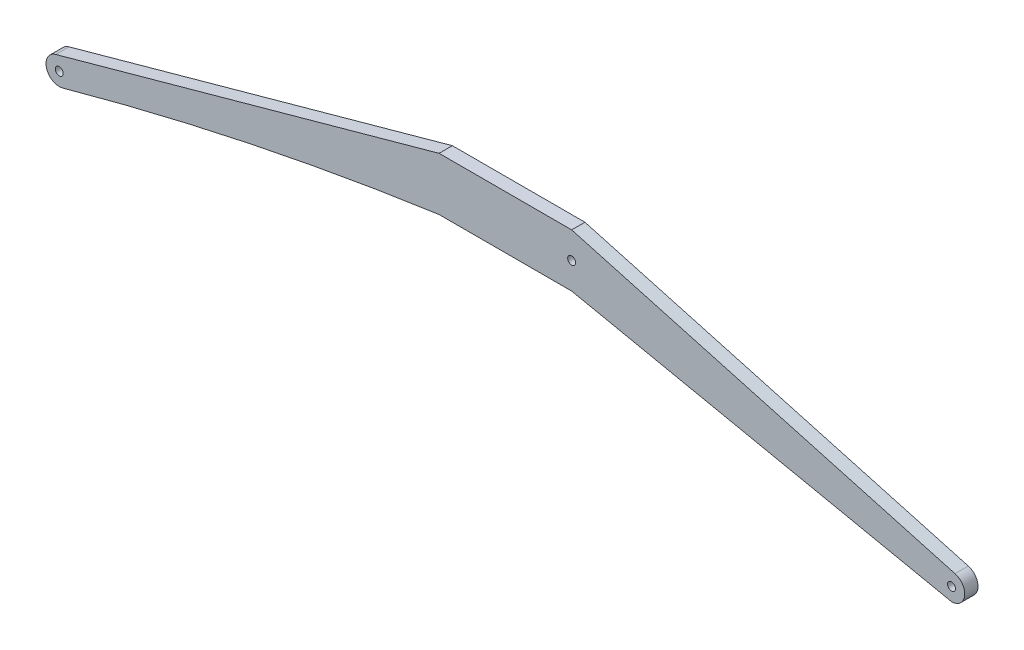
ISO-10303-21;
HEADER;
FILE_DESCRIPTION(('STEP AP214'),'2;1');
FILE_NAME('part.step','',(''),(''),'','','');
FILE_SCHEMA(('AUTOMOTIVE_DESIGN { 1 0 10303 214 1 1 1 1 }'));
ENDSEC;
DATA;
#1=APPLICATION_CONTEXT('core data for automotive mechanical design processes');
#2=APPLICATION_PROTOCOL_DEFINITION('international standard','automotive_design',2000,#1);
#3=PRODUCT_CONTEXT('',#1,'mechanical');
#4=PRODUCT('Part','Part','',(#3));
#5=PRODUCT_RELATED_PRODUCT_CATEGORY('part','',(#4));
#6=PRODUCT_DEFINITION_FORMATION('','',#4);
#7=PRODUCT_DEFINITION_CONTEXT('part definition',#1,'design');
#8=PRODUCT_DEFINITION('design','',#6,#7);
#9=PRODUCT_DEFINITION_SHAPE('','',#8);
#10=(LENGTH_UNIT() NAMED_UNIT(*) SI_UNIT(.MILLI.,.METRE.));
#11=(NAMED_UNIT(*) PLANE_ANGLE_UNIT() SI_UNIT($,.RADIAN.));
#12=(NAMED_UNIT(*) SI_UNIT($,.STERADIAN.) SOLID_ANGLE_UNIT());
#13=UNCERTAINTY_MEASURE_WITH_UNIT(LENGTH_MEASURE(1.E-05),#10,'distance_accuracy_value','');
#14=(GEOMETRIC_REPRESENTATION_CONTEXT(3) GLOBAL_UNCERTAINTY_ASSIGNED_CONTEXT((#13)) GLOBAL_UNIT_ASSIGNED_CONTEXT((#10,
#11,#12)) REPRESENTATION_CONTEXT('',''));
#15=CARTESIAN_POINT('',(0.,0.,0.));
#16=DIRECTION('',(0.,0.,1.));
#17=DIRECTION('',(1.,0.,0.));
#18=AXIS2_PLACEMENT_3D('',#15,#16,#17);
#19=CARTESIAN_POINT('',(-33.6469979229352,-8.96378881965346,1.));
#20=DIRECTION('',(0.,0.,-1.));
#21=DIRECTION('',(-1.,0.,0.));
#22=AXIS2_PLACEMENT_3D('',#19,#20,#21);
#23=CYLINDRICAL_SURFACE('',#22,1.);
#24=CARTESIAN_POINT('',(-33.6469979229352,-8.96378881965346,0.));
#25=DIRECTION('',(0.,0.,1.));
#26=DIRECTION('',(1.,0.,0.));
#27=AXIS2_PLACEMENT_3D('',#24,#25,#26);
#28=CIRCLE('',#27,1.);
#29=CARTESIAN_POINT('',(-33.9136645896019,-8.00000000000001,0.));
#30=VERTEX_POINT('',#29);
#31=CARTESIAN_POINT('',(-33.3803312562686,-9.9275776393068,0.));
#32=VERTEX_POINT('',#31);
#33=EDGE_CURVE('E142',#30,#32,#28,.T.);
#34=ORIENTED_EDGE('',*,*,#33,.T.);
#35=DIRECTION('',(0.,0.,-1.));
#36=VECTOR('',#35,1.);
#37=CARTESIAN_POINT('',(-33.3803312562686,-9.9275776393068,1.));
#38=LINE('',#37,#36);
#39=CARTESIAN_POINT('',(-33.3803312562686,-9.9275776393068,1.));
#40=VERTEX_POINT('',#39);
#41=EDGE_CURVE('E11',#40,#32,#38,.T.);
#42=ORIENTED_EDGE('',*,*,#41,.F.);
#43=CARTESIAN_POINT('',(-33.6469979229352,-8.96378881965346,1.));
#44=DIRECTION('',(0.,0.,1.));
#45=DIRECTION('',(1.,0.,0.));
#46=AXIS2_PLACEMENT_3D('',#43,#44,#45);
#47=CIRCLE('',#46,1.);
#48=CARTESIAN_POINT('',(-33.9136645896019,-8.00000000000001,1.));
#49=VERTEX_POINT('',#48);
#50=EDGE_CURVE('E168',#49,#40,#47,.T.);
#51=ORIENTED_EDGE('',*,*,#50,.F.);
#52=DIRECTION('',(0.,0.,-1.));
#53=VECTOR('',#52,1.);
#54=CARTESIAN_POINT('',(-33.9136645896019,-8.00000000000001,1.));
#55=LINE('',#54,#53);
#56=EDGE_CURVE('E141',#49,#30,#55,.T.);
#57=ORIENTED_EDGE('',*,*,#56,.T.);
#58=EDGE_LOOP('',(#34,#42,#51,#57));
#59=FACE_BOUND('',#58,.T.);
#60=ADVANCED_FACE('F38',(#59),#23,.T.);
#61=CARTESIAN_POINT('',(27.0336145789464,-228.276148441026,1.));
#62=DIRECTION('',(0.,0.,-1.));
#63=DIRECTION('',(-1.,0.,0.));
#64=AXIS2_PLACEMENT_3D('',#61,#62,#63);
#65=CYLINDRICAL_SURFACE('',#64,226.552296882053);
#66=CARTESIAN_POINT('',(27.0336145789464,-228.276148441026,0.));
#67=DIRECTION('',(0.,0.,1.));
#68=DIRECTION('',(1.,0.,0.));
#69=AXIS2_PLACEMENT_3D('',#66,#67,#68);
#70=CIRCLE('',#69,226.552296882053);
#71=CARTESIAN_POINT('',(-5.,-4.,0.));
#72=VERTEX_POINT('',#71);
#73=EDGE_CURVE('E145',#32,#72,#70,.F.);
#74=ORIENTED_EDGE('',*,*,#73,.T.);
#75=DIRECTION('',(0.,0.,-1.));
#76=VECTOR('',#75,1.);
#77=CARTESIAN_POINT('',(-5.,-4.,1.));
#78=LINE('',#77,#76);
#79=CARTESIAN_POINT('',(-5.,-4.,1.));
#80=VERTEX_POINT('',#79);
#81=EDGE_CURVE('E46',#80,#72,#78,.T.);
#82=ORIENTED_EDGE('',*,*,#81,.F.);
#83=CARTESIAN_POINT('',(27.0336145789464,-228.276148441026,1.));
#84=DIRECTION('',(0.,0.,1.));
#85=DIRECTION('',(1.,0.,0.));
#86=AXIS2_PLACEMENT_3D('',#83,#84,#85);
#87=CIRCLE('',#86,226.552296882053);
#88=EDGE_CURVE('E93',#40,#80,#87,.F.);
#89=ORIENTED_EDGE('',*,*,#88,.F.);
#90=ORIENTED_EDGE('',*,*,#41,.T.);
#91=EDGE_LOOP('',(#74,#82,#89,#90));
#92=FACE_BOUND('',#91,.T.);
#93=ADVANCED_FACE('F201',(#92),#65,.F.);
#94=CARTESIAN_POINT('',(0.,-4.,1.));
#95=DIRECTION('',(0.,1.,0.));
#96=DIRECTION('',(0.,0.,1.));
#97=AXIS2_PLACEMENT_3D('',#94,#95,#96);
#98=PLANE('',#97);
#99=DIRECTION('',(1.,0.,0.));
#100=VECTOR('',#99,1.);
#101=CARTESIAN_POINT('',(0.,-4.,0.));
#102=LINE('',#101,#100);
#103=CARTESIAN_POINT('',(5.,-4.,0.));
#104=VERTEX_POINT('',#103);
#105=EDGE_CURVE('E147',#72,#104,#102,.T.);
#106=ORIENTED_EDGE('',*,*,#105,.T.);
#107=DIRECTION('',(0.,0.,-1.));
#108=VECTOR('',#107,1.);
#109=CARTESIAN_POINT('',(5.,-4.,1.));
#110=LINE('',#109,#108);
#111=CARTESIAN_POINT('',(5.,-4.,1.));
#112=VERTEX_POINT('',#111);
#113=EDGE_CURVE('E174',#112,#104,#110,.T.);
#114=ORIENTED_EDGE('',*,*,#113,.F.);
#115=DIRECTION('',(1.,0.,0.));
#116=VECTOR('',#115,1.);
#117=CARTESIAN_POINT('',(0.,-4.,1.));
#118=LINE('',#117,#116);
#119=EDGE_CURVE('E182',#80,#112,#118,.T.);
#120=ORIENTED_EDGE('',*,*,#119,.F.);
#121=ORIENTED_EDGE('',*,*,#81,.T.);
#122=EDGE_LOOP('',(#106,#114,#120,#121));
#123=FACE_BOUND('',#122,.T.);
#124=ADVANCED_FACE('F180',(#123),#98,.F.);
#125=CARTESIAN_POINT('',(-0.590439737350175,-2.836171172552,1.));
#126=DIRECTION('',(0.203812241610438,0.979009994928412,0.));
#127=DIRECTION('',(-0.979009994928412,0.203812241610438,0.));
#128=AXIS2_PLACEMENT_3D('',#125,#126,#127);
#129=PLANE('',#128);
#130=DIRECTION('',(0.979009994928412,-0.203812241610438,0.));
#131=VECTOR('',#130,1.);
#132=CARTESIAN_POINT('',(-0.590439737350175,-2.836171172552,0.));
#133=LINE('',#132,#131);
#134=CARTESIAN_POINT('',(33.6469979229352,-9.96378881965341,0.));
#135=VERTEX_POINT('',#134);
#136=EDGE_CURVE('E149',#104,#135,#133,.T.);
#137=ORIENTED_EDGE('',*,*,#136,.T.);
#138=DIRECTION('',(0.,0.,-1.));
#139=VECTOR('',#138,1.);
#140=CARTESIAN_POINT('',(33.6469979229352,-9.96378881965341,1.));
#141=LINE('',#140,#139);
#142=CARTESIAN_POINT('',(33.6469979229352,-9.96378881965341,1.));
#143=VERTEX_POINT('',#142);
#144=EDGE_CURVE('E172',#143,#135,#141,.T.);
#145=ORIENTED_EDGE('',*,*,#144,.F.);
#146=DIRECTION('',(0.979009994928412,-0.203812241610438,0.));
#147=VECTOR('',#146,1.);
#148=CARTESIAN_POINT('',(-0.590439737350175,-2.836171172552,1.));
#149=LINE('',#148,#147);
#150=EDGE_CURVE('E193',#112,#143,#149,.T.);
#151=ORIENTED_EDGE('',*,*,#150,.F.);
#152=ORIENTED_EDGE('',*,*,#113,.T.);
#153=EDGE_LOOP('',(#137,#145,#151,#152));
#154=FACE_BOUND('',#153,.T.);
#155=ADVANCED_FACE('F191',(#154),#129,.F.);
#156=CARTESIAN_POINT('',(33.6469979229352,-8.96378881965341,1.));
#157=DIRECTION('',(0.,0.,-1.));
#158=DIRECTION('',(-1.,0.,0.));
#159=AXIS2_PLACEMENT_3D('',#156,#157,#158);
#160=CYLINDRICAL_SURFACE('',#159,1.00000000000005);
#161=CARTESIAN_POINT('',(33.6469979229352,-8.96378881965341,0.));
#162=DIRECTION('',(0.,0.,1.));
#163=DIRECTION('',(1.,0.,0.));
#164=AXIS2_PLACEMENT_3D('',#161,#162,#163);
#165=CIRCLE('',#164,1.00000000000005);
#166=CARTESIAN_POINT('',(33.9136645896019,-8.,0.));
#167=VERTEX_POINT('',#166);
#168=EDGE_CURVE('E152',#167,#135,#165,.F.);
#169=ORIENTED_EDGE('',*,*,#168,.F.);
#170=DIRECTION('',(0.,0.,-1.));
#171=VECTOR('',#170,1.);
#172=CARTESIAN_POINT('',(33.9136645896019,-8.,1.));
#173=LINE('',#172,#171);
#174=CARTESIAN_POINT('',(33.9136645896019,-8.,1.));
#175=VERTEX_POINT('',#174);
#176=EDGE_CURVE('E118',#175,#167,#173,.T.);
#177=ORIENTED_EDGE('',*,*,#176,.F.);
#178=CARTESIAN_POINT('',(33.6469979229352,-8.96378881965341,1.));
#179=DIRECTION('',(0.,0.,1.));
#180=DIRECTION('',(1.,0.,0.));
#181=AXIS2_PLACEMENT_3D('',#178,#179,#180);
#182=CIRCLE('',#181,1.00000000000005);
#183=EDGE_CURVE('E125',#175,#143,#182,.F.);
#184=ORIENTED_EDGE('',*,*,#183,.T.);
#185=ORIENTED_EDGE('',*,*,#144,.T.);
#186=EDGE_LOOP('',(#169,#177,#184,#185));
#187=FACE_BOUND('',#186,.T.);
#188=ADVANCED_FACE('F211',(#187),#160,.T.);
#189=CARTESIAN_POINT('',(0.355555555555556,1.28505175953786,1.));
#190=DIRECTION('',(0.266666666666667,0.963788819653397,0.));
#191=DIRECTION('',(-0.963788819653397,0.266666666666667,0.));
#192=AXIS2_PLACEMENT_3D('',#189,#190,#191);
#193=PLANE('',#192);
#194=DIRECTION('',(0.963788819653397,-0.266666666666667,0.));
#195=VECTOR('',#194,1.);
#196=CARTESIAN_POINT('',(0.355555555555556,1.28505175953786,0.));
#197=LINE('',#196,#195);
#198=CARTESIAN_POINT('',(5.,0.,0.));
#199=VERTEX_POINT('',#198);
#200=EDGE_CURVE('E113',#199,#167,#197,.T.);
#201=ORIENTED_EDGE('',*,*,#200,.F.);
#202=DIRECTION('',(0.,0.,-1.));
#203=VECTOR('',#202,1.);
#204=CARTESIAN_POINT('',(5.,0.,1.));
#205=LINE('',#204,#203);
#206=CARTESIAN_POINT('',(5.,0.,1.));
#207=VERTEX_POINT('',#206);
#208=EDGE_CURVE('E108',#207,#199,#205,.T.);
#209=ORIENTED_EDGE('',*,*,#208,.F.);
#210=DIRECTION('',(0.963788819653397,-0.266666666666667,0.));
#211=VECTOR('',#210,1.);
#212=CARTESIAN_POINT('',(0.355555555555556,1.28505175953786,1.));
#213=LINE('',#212,#211);
#214=EDGE_CURVE('E111',#207,#175,#213,.T.);
#215=ORIENTED_EDGE('',*,*,#214,.T.);
#216=ORIENTED_EDGE('',*,*,#176,.T.);
#217=EDGE_LOOP('',(#201,#209,#215,#216));
#218=FACE_BOUND('',#217,.T.);
#219=ADVANCED_FACE('F110',(#218),#193,.T.);
#220=CARTESIAN_POINT('',(0.,0.,1.));
#221=DIRECTION('',(0.,1.,0.));
#222=DIRECTION('',(-1.,0.,0.));
#223=AXIS2_PLACEMENT_3D('',#220,#221,#222);
#224=PLANE('',#223);
#225=DIRECTION('',(1.,0.,0.));
#226=VECTOR('',#225,1.);
#227=CARTESIAN_POINT('',(0.,0.,0.));
#228=LINE('',#227,#226);
#229=CARTESIAN_POINT('',(-5.,0.,0.));
#230=VERTEX_POINT('',#229);
#231=EDGE_CURVE('E156',#230,#199,#228,.T.);
#232=ORIENTED_EDGE('',*,*,#231,.F.);
#233=DIRECTION('',(0.,0.,-1.));
#234=VECTOR('',#233,1.);
#235=CARTESIAN_POINT('',(-5.,0.,1.));
#236=LINE('',#235,#234);
#237=CARTESIAN_POINT('',(-5.,0.,1.));
#238=VERTEX_POINT('',#237);
#239=EDGE_CURVE('E82',#238,#230,#236,.T.);
#240=ORIENTED_EDGE('',*,*,#239,.F.);
#241=DIRECTION('',(1.,0.,0.));
#242=VECTOR('',#241,1.);
#243=CARTESIAN_POINT('',(0.,0.,1.));
#244=LINE('',#243,#242);
#245=EDGE_CURVE('E123',#238,#207,#244,.T.);
#246=ORIENTED_EDGE('',*,*,#245,.T.);
#247=ORIENTED_EDGE('',*,*,#208,.T.);
#248=EDGE_LOOP('',(#232,#240,#246,#247));
#249=FACE_BOUND('',#248,.T.);
#250=ADVANCED_FACE('F127',(#249),#224,.T.);
#251=CARTESIAN_POINT('',(-33.6469979229352,-8.96378881965346,1.));
#252=DIRECTION('',(0.,0.,-1.));
#253=DIRECTION('',(-1.,0.,0.));
#254=AXIS2_PLACEMENT_3D('',#251,#252,#253);
#255=CYLINDRICAL_SURFACE('',#254,0.300000000000005);
#256=CARTESIAN_POINT('',(-33.6469979229352,-8.96378881965346,1.));
#257=DIRECTION('',(0.,0.,1.));
#258=DIRECTION('',(1.,0.,0.));
#259=AXIS2_PLACEMENT_3D('',#256,#257,#258);
#260=CIRCLE('',#259,0.300000000000005);
#261=CARTESIAN_POINT('',(-33.3469979229352,-8.96378881965346,1.));
#262=VERTEX_POINT('',#261);
#263=EDGE_CURVE('E135',#262,#262,#260,.T.);
#264=ORIENTED_EDGE('',*,*,#263,.T.);
#265=EDGE_LOOP('',(#264));
#266=FACE_BOUND('',#265,.T.);
#267=CARTESIAN_POINT('',(-33.6469979229352,-8.96378881965346,0.));
#268=DIRECTION('',(0.,0.,1.));
#269=DIRECTION('',(1.,0.,0.));
#270=AXIS2_PLACEMENT_3D('',#267,#268,#269);
#271=CIRCLE('',#270,0.300000000000005);
#272=CARTESIAN_POINT('',(-33.3469979229352,-8.96378881965346,0.));
#273=VERTEX_POINT('',#272);
#274=EDGE_CURVE('E162',#273,#273,#271,.T.);
#275=ORIENTED_EDGE('',*,*,#274,.F.);
#276=EDGE_LOOP('',(#275));
#277=FACE_BOUND('',#276,.T.);
#278=ADVANCED_FACE('F219',(#266,#277),#255,.F.);
#279=CARTESIAN_POINT('',(5.,-2.,1.));
#280=DIRECTION('',(0.,0.,-1.));
#281=DIRECTION('',(-1.,0.,0.));
#282=AXIS2_PLACEMENT_3D('',#279,#280,#281);
#283=CYLINDRICAL_SURFACE('',#282,0.3);
#284=CARTESIAN_POINT('',(5.,-2.,1.));
#285=DIRECTION('',(0.,0.,1.));
#286=DIRECTION('',(1.,0.,0.));
#287=AXIS2_PLACEMENT_3D('',#284,#285,#286);
#288=CIRCLE('',#287,0.3);
#289=CARTESIAN_POINT('',(5.3,-2.,1.));
#290=VERTEX_POINT('',#289);
#291=EDGE_CURVE('E129',#290,#290,#288,.T.);
#292=ORIENTED_EDGE('',*,*,#291,.T.);
#293=EDGE_LOOP('',(#292));
#294=FACE_BOUND('',#293,.T.);
#295=CARTESIAN_POINT('',(5.,-2.,0.));
#296=DIRECTION('',(0.,0.,1.));
#297=DIRECTION('',(1.,0.,0.));
#298=AXIS2_PLACEMENT_3D('',#295,#296,#297);
#299=CIRCLE('',#298,0.3);
#300=CARTESIAN_POINT('',(5.3,-2.,0.));
#301=VERTEX_POINT('',#300);
#302=EDGE_CURVE('E159',#301,#301,#299,.T.);
#303=ORIENTED_EDGE('',*,*,#302,.F.);
#304=EDGE_LOOP('',(#303));
#305=FACE_BOUND('',#304,.T.);
#306=ADVANCED_FACE('F224',(#294,#305),#283,.F.);
#307=CARTESIAN_POINT('',(-0.355555555555556,1.28505175953786,1.));
#308=DIRECTION('',(0.266666666666667,-0.963788819653397,0.));
#309=DIRECTION('',(0.963788819653397,0.266666666666667,0.));
#310=AXIS2_PLACEMENT_3D('',#307,#308,#309);
#311=PLANE('',#310);
#312=DIRECTION('',(-0.963788819653397,-0.266666666666667,0.));
#313=VECTOR('',#312,1.);
#314=CARTESIAN_POINT('',(-0.355555555555556,1.28505175953786,0.));
#315=LINE('',#314,#313);
#316=EDGE_CURVE('E85',#230,#30,#315,.T.);
#317=ORIENTED_EDGE('',*,*,#316,.T.);
#318=ORIENTED_EDGE('',*,*,#56,.F.);
#319=DIRECTION('',(-0.963788819653397,-0.266666666666667,0.));
#320=VECTOR('',#319,1.);
#321=CARTESIAN_POINT('',(-0.355555555555556,1.28505175953786,1.));
#322=LINE('',#321,#320);
#323=EDGE_CURVE('E54',#238,#49,#322,.T.);
#324=ORIENTED_EDGE('',*,*,#323,.F.);
#325=ORIENTED_EDGE('',*,*,#239,.T.);
#326=EDGE_LOOP('',(#317,#318,#324,#325));
#327=FACE_BOUND('',#326,.T.);
#328=ADVANCED_FACE('F220',(#327),#311,.F.);
#329=CARTESIAN_POINT('',(33.6469979229352,-8.96378881965341,1.));
#330=DIRECTION('',(0.,0.,-1.));
#331=DIRECTION('',(-1.,0.,0.));
#332=AXIS2_PLACEMENT_3D('',#329,#330,#331);
#333=CYLINDRICAL_SURFACE('',#332,0.300000000000003);
#334=CARTESIAN_POINT('',(33.6469979229352,-8.96378881965341,1.));
#335=DIRECTION('',(0.,0.,1.));
#336=DIRECTION('',(1.,0.,0.));
#337=AXIS2_PLACEMENT_3D('',#334,#335,#336);
#338=CIRCLE('',#337,0.300000000000003);
#339=CARTESIAN_POINT('',(33.9469979229352,-8.96378881965341,1.));
#340=VERTEX_POINT('',#339);
#341=EDGE_CURVE('E138',#340,#340,#338,.F.);
#342=ORIENTED_EDGE('',*,*,#341,.F.);
#343=EDGE_LOOP('',(#342));
#344=FACE_BOUND('',#343,.T.);
#345=CARTESIAN_POINT('',(33.6469979229352,-8.96378881965341,0.));
#346=DIRECTION('',(0.,0.,1.));
#347=DIRECTION('',(1.,0.,0.));
#348=AXIS2_PLACEMENT_3D('',#345,#346,#347);
#349=CIRCLE('',#348,0.300000000000003);
#350=CARTESIAN_POINT('',(33.9469979229352,-8.96378881965341,0.));
#351=VERTEX_POINT('',#350);
#352=EDGE_CURVE('E165',#351,#351,#349,.F.);
#353=ORIENTED_EDGE('',*,*,#352,.T.);
#354=EDGE_LOOP('',(#353));
#355=FACE_BOUND('',#354,.T.);
#356=ADVANCED_FACE('F223',(#344,#355),#333,.F.);
#357=CARTESIAN_POINT('',(0.,0.,1.));
#358=DIRECTION('',(0.,0.,1.));
#359=DIRECTION('',(1.,0.,0.));
#360=AXIS2_PLACEMENT_3D('',#357,#358,#359);
#361=PLANE('',#360);
#362=ORIENTED_EDGE('',*,*,#50,.T.);
#363=ORIENTED_EDGE('',*,*,#88,.T.);
#364=ORIENTED_EDGE('',*,*,#119,.T.);
#365=ORIENTED_EDGE('',*,*,#150,.T.);
#366=ORIENTED_EDGE('',*,*,#183,.F.);
#367=ORIENTED_EDGE('',*,*,#214,.F.);
#368=ORIENTED_EDGE('',*,*,#245,.F.);
#369=ORIENTED_EDGE('',*,*,#323,.T.);
#370=EDGE_LOOP('',(#362,#363,#364,#365,#366,#367,#368,#369));
#371=FACE_BOUND('',#370,.T.);
#372=ORIENTED_EDGE('',*,*,#291,.F.);
#373=EDGE_LOOP('',(#372));
#374=FACE_BOUND('',#373,.T.);
#375=ORIENTED_EDGE('',*,*,#263,.F.);
#376=EDGE_LOOP('',(#375));
#377=FACE_BOUND('',#376,.T.);
#378=ORIENTED_EDGE('',*,*,#341,.T.);
#379=EDGE_LOOP('',(#378));
#380=FACE_BOUND('',#379,.T.);
#381=ADVANCED_FACE('F121',(#371,#374,#377,#380),#361,.T.);
#382=CARTESIAN_POINT('',(0.,0.,0.));
#383=DIRECTION('',(0.,0.,1.));
#384=DIRECTION('',(1.,0.,0.));
#385=AXIS2_PLACEMENT_3D('',#382,#383,#384);
#386=PLANE('',#385);
#387=ORIENTED_EDGE('',*,*,#33,.F.);
#388=ORIENTED_EDGE('',*,*,#316,.F.);
#389=ORIENTED_EDGE('',*,*,#231,.T.);
#390=ORIENTED_EDGE('',*,*,#200,.T.);
#391=ORIENTED_EDGE('',*,*,#168,.T.);
#392=ORIENTED_EDGE('',*,*,#136,.F.);
#393=ORIENTED_EDGE('',*,*,#105,.F.);
#394=ORIENTED_EDGE('',*,*,#73,.F.);
#395=EDGE_LOOP('',(#387,#388,#389,#390,#391,#392,#393,#394));
#396=FACE_BOUND('',#395,.T.);
#397=ORIENTED_EDGE('',*,*,#302,.T.);
#398=EDGE_LOOP('',(#397));
#399=FACE_BOUND('',#398,.T.);
#400=ORIENTED_EDGE('',*,*,#274,.T.);
#401=EDGE_LOOP('',(#400));
#402=FACE_BOUND('',#401,.T.);
#403=ORIENTED_EDGE('',*,*,#352,.F.);
#404=EDGE_LOOP('',(#403));
#405=FACE_BOUND('',#404,.T.);
#406=ADVANCED_FACE('F186',(#396,#399,#402,#405),#386,.F.);
#407=CLOSED_SHELL('',(#60,#93,#124,#155,#188,#219,#250,#278,#306,#328,#356,#381,#406));
#408=MANIFOLD_SOLID_BREP('B2',#407);
#409=ADVANCED_BREP_SHAPE_REPRESENTATION('',(#18,#408),#14);
#410=SHAPE_DEFINITION_REPRESENTATION(#9,#409);
ENDSEC;
END-ISO-10303-21;
